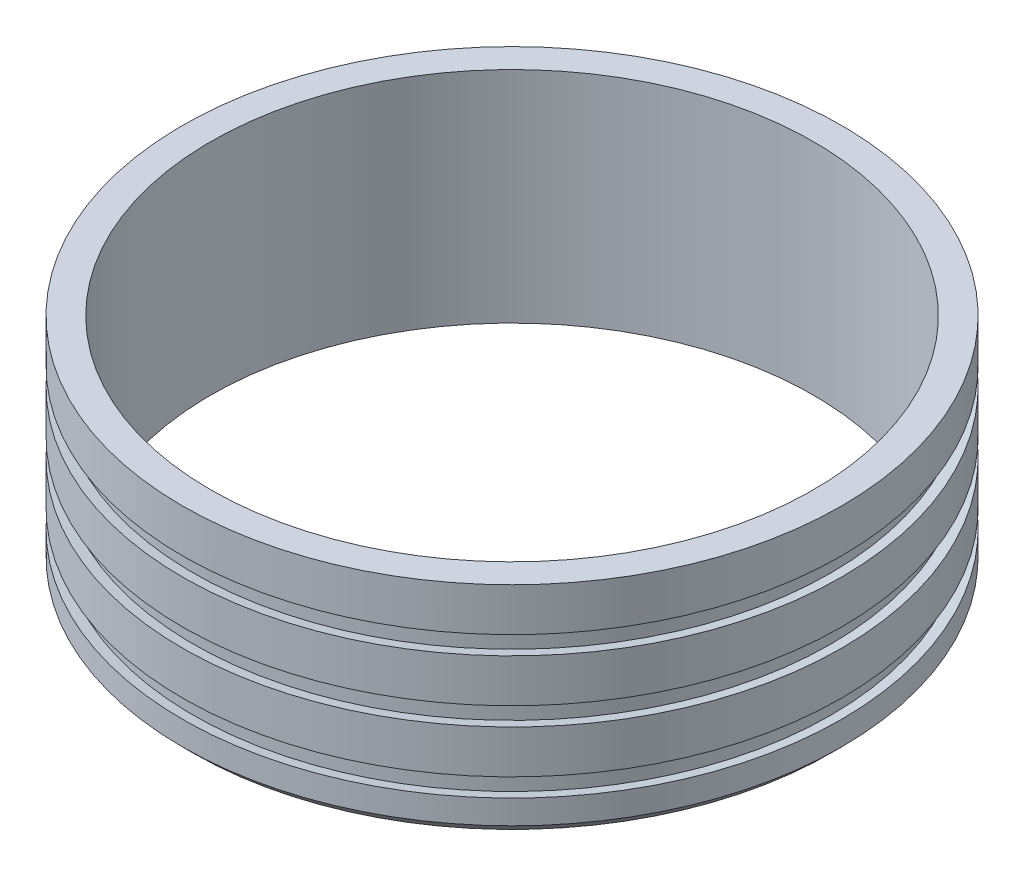
ISO-10303-21;
HEADER;
FILE_DESCRIPTION(('STEP AP214'),'2;1');
FILE_NAME('part.step','',(''),(''),'','','');
FILE_SCHEMA(('AUTOMOTIVE_DESIGN { 1 0 10303 214 1 1 1 1 }'));
ENDSEC;
DATA;
#1=APPLICATION_CONTEXT('core data for automotive mechanical design processes');
#2=APPLICATION_PROTOCOL_DEFINITION('international standard','automotive_design',2000,#1);
#3=PRODUCT_CONTEXT('',#1,'mechanical');
#4=PRODUCT('Part','Part','',(#3));
#5=PRODUCT_RELATED_PRODUCT_CATEGORY('part','',(#4));
#6=PRODUCT_DEFINITION_FORMATION('','',#4);
#7=PRODUCT_DEFINITION_CONTEXT('part definition',#1,'design');
#8=PRODUCT_DEFINITION('design','',#6,#7);
#9=PRODUCT_DEFINITION_SHAPE('','',#8);
#10=(LENGTH_UNIT() NAMED_UNIT(*) SI_UNIT(.MILLI.,.METRE.));
#11=(NAMED_UNIT(*) PLANE_ANGLE_UNIT() SI_UNIT($,.RADIAN.));
#12=(NAMED_UNIT(*) SI_UNIT($,.STERADIAN.) SOLID_ANGLE_UNIT());
#13=UNCERTAINTY_MEASURE_WITH_UNIT(LENGTH_MEASURE(1.E-05),#10,'distance_accuracy_value','');
#14=(GEOMETRIC_REPRESENTATION_CONTEXT(3) GLOBAL_UNCERTAINTY_ASSIGNED_CONTEXT((#13)) GLOBAL_UNIT_ASSIGNED_CONTEXT((#10,
#11,#12)) REPRESENTATION_CONTEXT('',''));
#15=CARTESIAN_POINT('',(0.,0.,0.));
#16=DIRECTION('',(0.,0.,1.));
#17=DIRECTION('',(1.,0.,0.));
#18=AXIS2_PLACEMENT_3D('',#15,#16,#17);
#19=CARTESIAN_POINT('',(0.,50.8,0.));
#20=DIRECTION('',(0.,-1.,0.));
#21=DIRECTION('',(0.,0.,-1.));
#22=AXIS2_PLACEMENT_3D('',#19,#20,#21);
#23=CYLINDRICAL_SURFACE('',#22,76.25);
#24=CARTESIAN_POINT('',(0.,50.8,0.));
#25=DIRECTION('',(0.,1.,0.));
#26=DIRECTION('',(0.,0.,1.));
#27=AXIS2_PLACEMENT_3D('',#24,#25,#26);
#28=CIRCLE('',#27,76.25);
#29=CARTESIAN_POINT('',(0.,50.8,76.25));
#30=VERTEX_POINT('',#29);
#31=EDGE_CURVE('E49',#30,#30,#28,.T.);
#32=ORIENTED_EDGE('',*,*,#31,.F.);
#33=EDGE_LOOP('',(#32));
#34=FACE_BOUND('',#33,.T.);
#35=CARTESIAN_POINT('',(0.,40.8,0.));
#36=DIRECTION('',(0.,-1.,0.));
#37=DIRECTION('',(1.,0.,0.));
#38=AXIS2_PLACEMENT_3D('',#35,#36,#37);
#39=CIRCLE('',#38,76.25);
#40=CARTESIAN_POINT('',(76.25,40.7999999999999,0.));
#41=VERTEX_POINT('',#40);
#42=EDGE_CURVE('E89',#41,#41,#39,.T.);
#43=ORIENTED_EDGE('',*,*,#42,.F.);
#44=EDGE_LOOP('',(#43));
#45=FACE_BOUND('',#44,.T.);
#46=ADVANCED_FACE('F37',(#34,#45),#23,.T.);
#47=CARTESIAN_POINT('',(0.,2.49999999999999,0.));
#48=DIRECTION('',(0.,1.,0.));
#49=DIRECTION('',(0.,0.,1.));
#50=AXIS2_PLACEMENT_3D('',#47,#48,#49);
#51=CIRCLE('',#50,76.25);
#52=CARTESIAN_POINT('',(0.,2.49999999999999,76.25));
#53=VERTEX_POINT('',#52);
#54=EDGE_CURVE('E45',#53,#53,#51,.T.);
#55=ORIENTED_EDGE('',*,*,#54,.T.);
#56=EDGE_LOOP('',(#55));
#57=FACE_BOUND('',#56,.T.);
#58=CARTESIAN_POINT('',(0.,8.04999999999995,0.));
#59=DIRECTION('',(0.,-1.,0.));
#60=DIRECTION('',(1.,0.,0.));
#61=AXIS2_PLACEMENT_3D('',#58,#59,#60);
#62=CIRCLE('',#61,76.2499999999999);
#63=CARTESIAN_POINT('',(76.2499999999999,8.04999999999991,0.));
#64=VERTEX_POINT('',#63);
#65=EDGE_CURVE('E62',#64,#64,#62,.T.);
#66=ORIENTED_EDGE('',*,*,#65,.T.);
#67=EDGE_LOOP('',(#66));
#68=FACE_BOUND('',#67,.T.);
#69=ADVANCED_FACE('F113',(#57,#68),#23,.T.);
#70=CARTESIAN_POINT('',(0.,50.8,0.));
#71=DIRECTION('',(0.,1.,0.));
#72=DIRECTION('',(0.,0.,1.));
#73=AXIS2_PLACEMENT_3D('',#70,#71,#72);
#74=PLANE('',#73);
#75=ORIENTED_EDGE('',*,*,#31,.T.);
#76=EDGE_LOOP('',(#75));
#77=FACE_BOUND('',#76,.T.);
#78=CARTESIAN_POINT('',(0.,50.8,0.));
#79=DIRECTION('',(0.,1.,0.));
#80=DIRECTION('',(0.,0.,1.));
#81=AXIS2_PLACEMENT_3D('',#78,#79,#80);
#82=CIRCLE('',#81,69.75);
#83=CARTESIAN_POINT('',(0.,50.8,69.75));
#84=VERTEX_POINT('',#83);
#85=EDGE_CURVE('E53',#84,#84,#82,.T.);
#86=ORIENTED_EDGE('',*,*,#85,.F.);
#87=EDGE_LOOP('',(#86));
#88=FACE_BOUND('',#87,.T.);
#89=ADVANCED_FACE('F121',(#77,#88),#74,.T.);
#90=CARTESIAN_POINT('',(0.,0.,0.));
#91=DIRECTION('',(0.,1.,0.));
#92=DIRECTION('',(0.,0.,1.));
#93=AXIS2_PLACEMENT_3D('',#90,#91,#92);
#94=PLANE('',#93);
#95=CARTESIAN_POINT('',(0.,0.,0.));
#96=DIRECTION('',(0.,1.,0.));
#97=DIRECTION('',(0.,0.,1.));
#98=AXIS2_PLACEMENT_3D('',#95,#96,#97);
#99=CIRCLE('',#98,73.75);
#100=CARTESIAN_POINT('',(0.,0.,73.75));
#101=VERTEX_POINT('',#100);
#102=EDGE_CURVE('E10',#101,#101,#99,.F.);
#103=ORIENTED_EDGE('',*,*,#102,.T.);
#104=EDGE_LOOP('',(#103));
#105=FACE_BOUND('',#104,.T.);
#106=CARTESIAN_POINT('',(0.,0.,0.));
#107=DIRECTION('',(0.,1.,0.));
#108=DIRECTION('',(0.,0.,1.));
#109=AXIS2_PLACEMENT_3D('',#106,#107,#108);
#110=CIRCLE('',#109,69.75);
#111=CARTESIAN_POINT('',(0.,0.,69.75));
#112=VERTEX_POINT('',#111);
#113=EDGE_CURVE('E56',#112,#112,#110,.T.);
#114=ORIENTED_EDGE('',*,*,#113,.T.);
#115=EDGE_LOOP('',(#114));
#116=FACE_BOUND('',#115,.T.);
#117=ADVANCED_FACE('F164',(#105,#116),#94,.F.);
#118=CARTESIAN_POINT('',(0.,50.8,0.));
#119=DIRECTION('',(0.,-1.,0.));
#120=DIRECTION('',(0.,0.,-1.));
#121=AXIS2_PLACEMENT_3D('',#118,#119,#120);
#122=CYLINDRICAL_SURFACE('',#121,69.75);
#123=ORIENTED_EDGE('',*,*,#85,.T.);
#124=EDGE_LOOP('',(#123));
#125=FACE_BOUND('',#124,.T.);
#126=ORIENTED_EDGE('',*,*,#113,.F.);
#127=EDGE_LOOP('',(#126));
#128=FACE_BOUND('',#127,.T.);
#129=ADVANCED_FACE('F160',(#125,#128),#122,.F.);
#130=CARTESIAN_POINT('',(0.,8.04999999999995,0.));
#131=DIRECTION('',(0.,1.,0.));
#132=DIRECTION('',(-1.,0.,0.));
#133=AXIS2_PLACEMENT_3D('',#130,#131,#132);
#134=CONICAL_SURFACE('',#133,76.2499999999999,1.39626340159546);
#135=CARTESIAN_POINT('',(0.,7.60918254822878,0.));
#136=DIRECTION('',(0.,-1.,0.));
#137=DIRECTION('',(1.,0.,0.));
#138=AXIS2_PLACEMENT_3D('',#135,#136,#137);
#139=CIRCLE('',#138,73.75);
#140=CARTESIAN_POINT('',(73.7499999999999,7.60918254822874,0.));
#141=VERTEX_POINT('',#140);
#142=EDGE_CURVE('E72',#141,#141,#139,.T.);
#143=ORIENTED_EDGE('',*,*,#142,.T.);
#144=EDGE_LOOP('',(#143));
#145=FACE_BOUND('',#144,.T.);
#146=ORIENTED_EDGE('',*,*,#65,.F.);
#147=EDGE_LOOP('',(#146));
#148=FACE_BOUND('',#147,.T.);
#149=ADVANCED_FACE('F156',(#145,#148),#134,.F.);
#150=CARTESIAN_POINT('',(0.,12.7408174517711,0.));
#151=DIRECTION('',(0.,-1.,0.));
#152=DIRECTION('',(1.,0.,0.));
#153=AXIS2_PLACEMENT_3D('',#150,#151,#152);
#154=CONICAL_SURFACE('',#153,73.75,1.39626340159546);
#155=CARTESIAN_POINT('',(0.,12.3,0.));
#156=DIRECTION('',(0.,-1.,0.));
#157=DIRECTION('',(1.,0.,0.));
#158=AXIS2_PLACEMENT_3D('',#155,#156,#157);
#159=CIRCLE('',#158,76.2499999999999);
#160=CARTESIAN_POINT('',(76.2499999999999,12.2999999999999,0.));
#161=VERTEX_POINT('',#160);
#162=EDGE_CURVE('E66',#161,#161,#159,.T.);
#163=ORIENTED_EDGE('',*,*,#162,.T.);
#164=EDGE_LOOP('',(#163));
#165=FACE_BOUND('',#164,.T.);
#166=CARTESIAN_POINT('',(0.,12.7408174517711,0.));
#167=DIRECTION('',(0.,-1.,0.));
#168=DIRECTION('',(1.,0.,0.));
#169=AXIS2_PLACEMENT_3D('',#166,#167,#168);
#170=CIRCLE('',#169,73.75);
#171=CARTESIAN_POINT('',(73.75,12.7408174517711,0.));
#172=VERTEX_POINT('',#171);
#173=EDGE_CURVE('E69',#172,#172,#170,.T.);
#174=ORIENTED_EDGE('',*,*,#173,.F.);
#175=EDGE_LOOP('',(#174));
#176=FACE_BOUND('',#175,.T.);
#177=ADVANCED_FACE('F143',(#165,#176),#154,.F.);
#178=CARTESIAN_POINT('',(0.,0.,0.));
#179=DIRECTION('',(0.,-1.,0.));
#180=DIRECTION('',(1.,0.,0.));
#181=AXIS2_PLACEMENT_3D('',#178,#179,#180);
#182=CYLINDRICAL_SURFACE('',#181,73.75);
#183=ORIENTED_EDGE('',*,*,#173,.T.);
#184=EDGE_LOOP('',(#183));
#185=FACE_BOUND('',#184,.T.);
#186=ORIENTED_EDGE('',*,*,#142,.F.);
#187=EDGE_LOOP('',(#186));
#188=FACE_BOUND('',#187,.T.);
#189=ADVANCED_FACE('F138',(#185,#188),#182,.T.);
#190=CARTESIAN_POINT('',(0.,36.5499999999999,0.));
#191=DIRECTION('',(0.,1.,0.));
#192=DIRECTION('',(-1.,0.,0.));
#193=AXIS2_PLACEMENT_3D('',#190,#191,#192);
#194=CONICAL_SURFACE('',#193,76.25,1.39626340159546);
#195=CARTESIAN_POINT('',(0.,36.1091825482288,0.));
#196=DIRECTION('',(0.,-1.,0.));
#197=DIRECTION('',(1.,0.,0.));
#198=AXIS2_PLACEMENT_3D('',#195,#196,#197);
#199=CIRCLE('',#198,73.75);
#200=CARTESIAN_POINT('',(73.75,36.1091825482287,0.));
#201=VERTEX_POINT('',#200);
#202=EDGE_CURVE('E78',#201,#201,#199,.T.);
#203=ORIENTED_EDGE('',*,*,#202,.T.);
#204=EDGE_LOOP('',(#203));
#205=FACE_BOUND('',#204,.T.);
#206=CARTESIAN_POINT('',(0.,36.5499999999999,0.));
#207=DIRECTION('',(0.,-1.,0.));
#208=DIRECTION('',(1.,0.,0.));
#209=AXIS2_PLACEMENT_3D('',#206,#207,#208);
#210=CIRCLE('',#209,76.25);
#211=CARTESIAN_POINT('',(76.2499999999999,36.5499999999999,0.));
#212=VERTEX_POINT('',#211);
#213=EDGE_CURVE('E59',#212,#212,#210,.T.);
#214=ORIENTED_EDGE('',*,*,#213,.F.);
#215=EDGE_LOOP('',(#214));
#216=FACE_BOUND('',#215,.T.);
#217=ADVANCED_FACE('F98',(#205,#216),#194,.F.);
#218=CARTESIAN_POINT('',(0.,41.2408174517711,0.));
#219=DIRECTION('',(0.,-1.,0.));
#220=DIRECTION('',(1.,0.,0.));
#221=AXIS2_PLACEMENT_3D('',#218,#219,#220);
#222=CONICAL_SURFACE('',#221,73.75,1.39626340159546);
#223=ORIENTED_EDGE('',*,*,#42,.T.);
#224=EDGE_LOOP('',(#223));
#225=FACE_BOUND('',#224,.T.);
#226=CARTESIAN_POINT('',(0.,41.2408174517711,0.));
#227=DIRECTION('',(0.,-1.,0.));
#228=DIRECTION('',(1.,0.,0.));
#229=AXIS2_PLACEMENT_3D('',#226,#227,#228);
#230=CIRCLE('',#229,73.75);
#231=CARTESIAN_POINT('',(73.75,41.2408174517711,0.));
#232=VERTEX_POINT('',#231);
#233=EDGE_CURVE('E92',#232,#232,#230,.T.);
#234=ORIENTED_EDGE('',*,*,#233,.F.);
#235=EDGE_LOOP('',(#234));
#236=FACE_BOUND('',#235,.T.);
#237=ADVANCED_FACE('F104',(#225,#236),#222,.F.);
#238=CARTESIAN_POINT('',(0.,0.,0.));
#239=DIRECTION('',(0.,-1.,0.));
#240=DIRECTION('',(1.,0.,0.));
#241=AXIS2_PLACEMENT_3D('',#238,#239,#240);
#242=CYLINDRICAL_SURFACE('',#241,73.75);
#243=ORIENTED_EDGE('',*,*,#233,.T.);
#244=EDGE_LOOP('',(#243));
#245=FACE_BOUND('',#244,.T.);
#246=ORIENTED_EDGE('',*,*,#202,.F.);
#247=EDGE_LOOP('',(#246));
#248=FACE_BOUND('',#247,.T.);
#249=ADVANCED_FACE('F101',(#245,#248),#242,.T.);
#250=ORIENTED_EDGE('',*,*,#162,.F.);
#251=EDGE_LOOP('',(#250));
#252=FACE_BOUND('',#251,.T.);
#253=CARTESIAN_POINT('',(0.,22.3,0.));
#254=DIRECTION('',(0.,-1.,0.));
#255=DIRECTION('',(1.,0.,0.));
#256=AXIS2_PLACEMENT_3D('',#253,#254,#255);
#257=CIRCLE('',#256,76.25);
#258=CARTESIAN_POINT('',(76.2499999999999,22.2999999999999,0.));
#259=VERTEX_POINT('',#258);
#260=EDGE_CURVE('E75',#259,#259,#257,.T.);
#261=ORIENTED_EDGE('',*,*,#260,.T.);
#262=EDGE_LOOP('',(#261));
#263=FACE_BOUND('',#262,.T.);
#264=ADVANCED_FACE('F103',(#252,#263),#23,.T.);
#265=CARTESIAN_POINT('',(0.,26.5499999999999,0.));
#266=DIRECTION('',(0.,-1.,0.));
#267=DIRECTION('',(1.,0.,0.));
#268=AXIS2_PLACEMENT_3D('',#265,#266,#267);
#269=CIRCLE('',#268,76.25);
#270=CARTESIAN_POINT('',(76.2499999999999,26.5499999999999,0.));
#271=VERTEX_POINT('',#270);
#272=EDGE_CURVE('E79',#271,#271,#269,.T.);
#273=ORIENTED_EDGE('',*,*,#272,.F.);
#274=EDGE_LOOP('',(#273));
#275=FACE_BOUND('',#274,.T.);
#276=ORIENTED_EDGE('',*,*,#213,.T.);
#277=EDGE_LOOP('',(#276));
#278=FACE_BOUND('',#277,.T.);
#279=ADVANCED_FACE('F111',(#275,#278),#23,.T.);
#280=CARTESIAN_POINT('',(0.,22.3,0.));
#281=DIRECTION('',(0.,1.,0.));
#282=DIRECTION('',(-1.,0.,0.));
#283=AXIS2_PLACEMENT_3D('',#280,#281,#282);
#284=CONICAL_SURFACE('',#283,76.25,1.39626340159546);
#285=CARTESIAN_POINT('',(0.,21.8591825482288,0.));
#286=DIRECTION('',(0.,-1.,0.));
#287=DIRECTION('',(1.,0.,0.));
#288=AXIS2_PLACEMENT_3D('',#285,#286,#287);
#289=CIRCLE('',#288,73.75);
#290=CARTESIAN_POINT('',(73.75,21.8591825482287,0.));
#291=VERTEX_POINT('',#290);
#292=EDGE_CURVE('E65',#291,#291,#289,.T.);
#293=ORIENTED_EDGE('',*,*,#292,.T.);
#294=EDGE_LOOP('',(#293));
#295=FACE_BOUND('',#294,.T.);
#296=ORIENTED_EDGE('',*,*,#260,.F.);
#297=EDGE_LOOP('',(#296));
#298=FACE_BOUND('',#297,.T.);
#299=ADVANCED_FACE('F126',(#295,#298),#284,.F.);
#300=CARTESIAN_POINT('',(0.,26.9908174517711,0.));
#301=DIRECTION('',(0.,-1.,0.));
#302=DIRECTION('',(1.,0.,0.));
#303=AXIS2_PLACEMENT_3D('',#300,#301,#302);
#304=CONICAL_SURFACE('',#303,73.75,1.39626340159546);
#305=ORIENTED_EDGE('',*,*,#272,.T.);
#306=EDGE_LOOP('',(#305));
#307=FACE_BOUND('',#306,.T.);
#308=CARTESIAN_POINT('',(0.,26.9908174517711,0.));
#309=DIRECTION('',(0.,-1.,0.));
#310=DIRECTION('',(1.,0.,0.));
#311=AXIS2_PLACEMENT_3D('',#308,#309,#310);
#312=CIRCLE('',#311,73.75);
#313=CARTESIAN_POINT('',(73.75,26.9908174517711,0.));
#314=VERTEX_POINT('',#313);
#315=EDGE_CURVE('E82',#314,#314,#312,.T.);
#316=ORIENTED_EDGE('',*,*,#315,.F.);
#317=EDGE_LOOP('',(#316));
#318=FACE_BOUND('',#317,.T.);
#319=ADVANCED_FACE('F131',(#307,#318),#304,.F.);
#320=CARTESIAN_POINT('',(0.,0.,0.));
#321=DIRECTION('',(0.,-1.,0.));
#322=DIRECTION('',(1.,0.,0.));
#323=AXIS2_PLACEMENT_3D('',#320,#321,#322);
#324=CYLINDRICAL_SURFACE('',#323,73.75);
#325=ORIENTED_EDGE('',*,*,#315,.T.);
#326=EDGE_LOOP('',(#325));
#327=FACE_BOUND('',#326,.T.);
#328=ORIENTED_EDGE('',*,*,#292,.F.);
#329=EDGE_LOOP('',(#328));
#330=FACE_BOUND('',#329,.T.);
#331=ADVANCED_FACE('F147',(#327,#330),#324,.T.);
#332=CARTESIAN_POINT('',(0.,2.49999999999999,0.));
#333=DIRECTION('',(0.,1.,0.));
#334=DIRECTION('',(0.,0.,1.));
#335=AXIS2_PLACEMENT_3D('',#332,#333,#334);
#336=CONICAL_SURFACE('',#335,76.25,0.785398163397451);
#337=ORIENTED_EDGE('',*,*,#102,.F.);
#338=EDGE_LOOP('',(#337));
#339=FACE_BOUND('',#338,.T.);
#340=ORIENTED_EDGE('',*,*,#54,.F.);
#341=EDGE_LOOP('',(#340));
#342=FACE_BOUND('',#341,.T.);
#343=ADVANCED_FACE('F40',(#339,#342),#336,.T.);
#344=CLOSED_SHELL('',(#46,#69,#89,#117,#129,#149,#177,#189,#217,#237,#249,#264,#279,#299,#319,
#331,#343));
#345=MANIFOLD_SOLID_BREP('B2',#344);
#346=ADVANCED_BREP_SHAPE_REPRESENTATION('',(#18,#345),#14);
#347=SHAPE_DEFINITION_REPRESENTATION(#9,#346);
ENDSEC;
END-ISO-10303-21;
